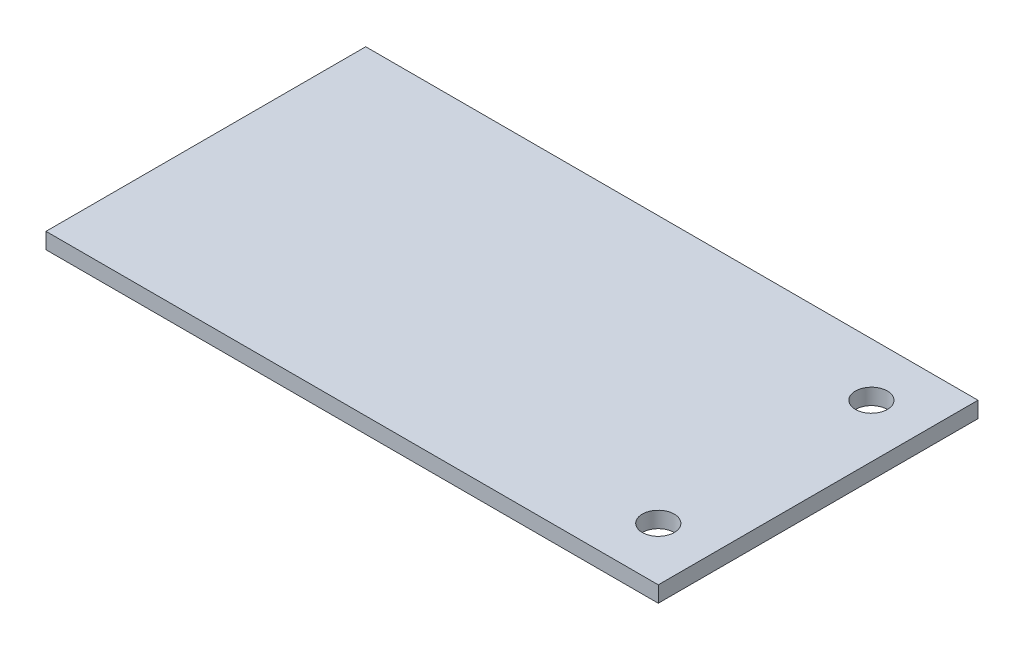
ISO-10303-21;
HEADER;
FILE_DESCRIPTION(('STEP AP214'),'2;1');
FILE_NAME('part.step','',(''),(''),'','','');
FILE_SCHEMA(('AUTOMOTIVE_DESIGN { 1 0 10303 214 1 1 1 1 }'));
ENDSEC;
DATA;
#1=APPLICATION_CONTEXT('core data for automotive mechanical design processes');
#2=APPLICATION_PROTOCOL_DEFINITION('international standard','automotive_design',2000,#1);
#3=PRODUCT_CONTEXT('',#1,'mechanical');
#4=PRODUCT('Part','Part','',(#3));
#5=PRODUCT_RELATED_PRODUCT_CATEGORY('part','',(#4));
#6=PRODUCT_DEFINITION_FORMATION('','',#4);
#7=PRODUCT_DEFINITION_CONTEXT('part definition',#1,'design');
#8=PRODUCT_DEFINITION('design','',#6,#7);
#9=PRODUCT_DEFINITION_SHAPE('','',#8);
#10=(LENGTH_UNIT() NAMED_UNIT(*) SI_UNIT(.MILLI.,.METRE.));
#11=(NAMED_UNIT(*) PLANE_ANGLE_UNIT() SI_UNIT($,.RADIAN.));
#12=(NAMED_UNIT(*) SI_UNIT($,.STERADIAN.) SOLID_ANGLE_UNIT());
#13=UNCERTAINTY_MEASURE_WITH_UNIT(LENGTH_MEASURE(1.E-05),#10,'distance_accuracy_value','');
#14=(GEOMETRIC_REPRESENTATION_CONTEXT(3) GLOBAL_UNCERTAINTY_ASSIGNED_CONTEXT((#13)) GLOBAL_UNIT_ASSIGNED_CONTEXT((#10,
#11,#12)) REPRESENTATION_CONTEXT('',''));
#15=CARTESIAN_POINT('',(0.,0.,0.));
#16=DIRECTION('',(0.,0.,1.));
#17=DIRECTION('',(1.,0.,0.));
#18=AXIS2_PLACEMENT_3D('',#15,#16,#17);
#19=CARTESIAN_POINT('',(-67.5,3.,-55.));
#20=DIRECTION('',(0.,0.,-1.));
#21=DIRECTION('',(0.,-1.,0.));
#22=AXIS2_PLACEMENT_3D('',#19,#20,#21);
#23=PLANE('',#22);
#24=DIRECTION('',(0.,1.,0.));
#25=VECTOR('',#24,1.);
#26=CARTESIAN_POINT('',(-47.4,-0.00100000000000013,-55.));
#27=LINE('',#26,#25);
#28=CARTESIAN_POINT('',(-47.4,0.,-55.));
#29=VERTEX_POINT('',#28);
#30=CARTESIAN_POINT('',(-47.4,3.,-55.));
#31=VERTEX_POINT('',#30);
#32=EDGE_CURVE('E96',#29,#31,#27,.T.);
#33=ORIENTED_EDGE('',*,*,#32,.T.);
#34=DIRECTION('',(1.,0.,0.));
#35=VECTOR('',#34,1.);
#36=CARTESIAN_POINT('',(-67.5,3.,-55.));
#37=LINE('',#36,#35);
#38=CARTESIAN_POINT('',(67.5,3.,-55.));
#39=VERTEX_POINT('',#38);
#40=EDGE_CURVE('E53',#31,#39,#37,.T.);
#41=ORIENTED_EDGE('',*,*,#40,.T.);
#42=DIRECTION('',(0.,-1.,0.));
#43=VECTOR('',#42,1.);
#44=CARTESIAN_POINT('',(67.5,3.,-55.));
#45=LINE('',#44,#43);
#46=CARTESIAN_POINT('',(67.5,0.,-55.));
#47=VERTEX_POINT('',#46);
#48=EDGE_CURVE('E95',#39,#47,#45,.T.);
#49=ORIENTED_EDGE('',*,*,#48,.T.);
#50=DIRECTION('',(1.,0.,0.));
#51=VECTOR('',#50,1.);
#52=CARTESIAN_POINT('',(-67.5,0.,-55.));
#53=LINE('',#52,#51);
#54=EDGE_CURVE('E113',#29,#47,#53,.T.);
#55=ORIENTED_EDGE('',*,*,#54,.F.);
#56=EDGE_LOOP('',(#33,#41,#49,#55));
#57=FACE_BOUND('',#56,.T.);
#58=ADVANCED_FACE('F43',(#57),#23,.T.);
#59=CARTESIAN_POINT('',(67.5,3.,-55.));
#60=DIRECTION('',(1.,0.,0.));
#61=DIRECTION('',(0.,1.,0.));
#62=AXIS2_PLACEMENT_3D('',#59,#60,#61);
#63=PLANE('',#62);
#64=DIRECTION('',(0.,0.,1.));
#65=VECTOR('',#64,1.);
#66=CARTESIAN_POINT('',(67.5,0.,-55.));
#67=LINE('',#66,#65);
#68=CARTESIAN_POINT('',(67.5,0.,5.));
#69=VERTEX_POINT('',#68);
#70=EDGE_CURVE('E82',#47,#69,#67,.T.);
#71=ORIENTED_EDGE('',*,*,#70,.F.);
#72=ORIENTED_EDGE('',*,*,#48,.F.);
#73=DIRECTION('',(0.,0.,1.));
#74=VECTOR('',#73,1.);
#75=CARTESIAN_POINT('',(67.5,3.,-55.));
#76=LINE('',#75,#74);
#77=CARTESIAN_POINT('',(67.5,3.,5.));
#78=VERTEX_POINT('',#77);
#79=EDGE_CURVE('E102',#39,#78,#76,.T.);
#80=ORIENTED_EDGE('',*,*,#79,.T.);
#81=DIRECTION('',(0.,-1.,0.));
#82=VECTOR('',#81,1.);
#83=CARTESIAN_POINT('',(67.5,3.,5.));
#84=LINE('',#83,#82);
#85=EDGE_CURVE('E47',#78,#69,#84,.T.);
#86=ORIENTED_EDGE('',*,*,#85,.T.);
#87=EDGE_LOOP('',(#71,#72,#80,#86));
#88=FACE_BOUND('',#87,.T.);
#89=ADVANCED_FACE('F101',(#88),#63,.T.);
#90=CARTESIAN_POINT('',(67.5,3.,5.));
#91=DIRECTION('',(0.,0.,1.));
#92=DIRECTION('',(1.,0.,0.));
#93=AXIS2_PLACEMENT_3D('',#90,#91,#92);
#94=PLANE('',#93);
#95=DIRECTION('',(-1.,0.,0.));
#96=VECTOR('',#95,1.);
#97=CARTESIAN_POINT('',(67.5,0.,5.));
#98=LINE('',#97,#96);
#99=CARTESIAN_POINT('',(-47.4,0.,5.));
#100=VERTEX_POINT('',#99);
#101=EDGE_CURVE('E114',#69,#100,#98,.T.);
#102=ORIENTED_EDGE('',*,*,#101,.F.);
#103=ORIENTED_EDGE('',*,*,#85,.F.);
#104=DIRECTION('',(-1.,0.,0.));
#105=VECTOR('',#104,1.);
#106=CARTESIAN_POINT('',(67.5,3.,5.));
#107=LINE('',#106,#105);
#108=CARTESIAN_POINT('',(-47.4,3.,5.));
#109=VERTEX_POINT('',#108);
#110=EDGE_CURVE('E105',#78,#109,#107,.T.);
#111=ORIENTED_EDGE('',*,*,#110,.T.);
#112=DIRECTION('',(0.,-1.,0.));
#113=VECTOR('',#112,1.);
#114=CARTESIAN_POINT('',(-47.4,-0.00100000000000013,5.));
#115=LINE('',#114,#113);
#116=EDGE_CURVE('E12',#109,#100,#115,.T.);
#117=ORIENTED_EDGE('',*,*,#116,.T.);
#118=EDGE_LOOP('',(#102,#103,#111,#117));
#119=FACE_BOUND('',#118,.T.);
#120=ADVANCED_FACE('F45',(#119),#94,.T.);
#121=CARTESIAN_POINT('',(0.,3.,0.));
#122=DIRECTION('',(0.,-1.,0.));
#123=DIRECTION('',(0.,0.,-1.));
#124=AXIS2_PLACEMENT_3D('',#121,#122,#123);
#125=PLANE('',#124);
#126=CARTESIAN_POINT('',(57.5000005434817,3.,-45.0000005434817));
#127=DIRECTION('',(0.,-1.,0.));
#128=DIRECTION('',(0.,0.,1.));
#129=AXIS2_PLACEMENT_3D('',#126,#127,#128);
#130=CIRCLE('',#129,3.);
#131=CARTESIAN_POINT('',(57.5000005434817,3.,-42.0000005434817));
#132=VERTEX_POINT('',#131);
#133=EDGE_CURVE('E122',#132,#132,#130,.T.);
#134=ORIENTED_EDGE('',*,*,#133,.T.);
#135=EDGE_LOOP('',(#134));
#136=FACE_BOUND('',#135,.T.);
#137=CARTESIAN_POINT('',(57.5000005434817,3.,-4.99999945651831));
#138=DIRECTION('',(0.,-1.,0.));
#139=DIRECTION('',(0.,0.,-1.));
#140=AXIS2_PLACEMENT_3D('',#137,#138,#139);
#141=CIRCLE('',#140,3.);
#142=CARTESIAN_POINT('',(57.5000005434817,3.,-7.99999945651831));
#143=VERTEX_POINT('',#142);
#144=EDGE_CURVE('E115',#143,#143,#141,.T.);
#145=ORIENTED_EDGE('',*,*,#144,.T.);
#146=EDGE_LOOP('',(#145));
#147=FACE_BOUND('',#146,.T.);
#148=ORIENTED_EDGE('',*,*,#40,.F.);
#149=DIRECTION('',(0.,0.,-1.));
#150=VECTOR('',#149,1.);
#151=CARTESIAN_POINT('',(-47.4,3.,3.2));
#152=LINE('',#151,#150);
#153=EDGE_CURVE('E62',#109,#31,#152,.T.);
#154=ORIENTED_EDGE('',*,*,#153,.F.);
#155=ORIENTED_EDGE('',*,*,#110,.F.);
#156=ORIENTED_EDGE('',*,*,#79,.F.);
#157=EDGE_LOOP('',(#148,#154,#155,#156));
#158=FACE_BOUND('',#157,.T.);
#159=ADVANCED_FACE('F104',(#136,#147,#158),#125,.F.);
#160=CARTESIAN_POINT('',(0.,0.,0.));
#161=DIRECTION('',(0.,-1.,0.));
#162=DIRECTION('',(0.,0.,-1.));
#163=AXIS2_PLACEMENT_3D('',#160,#161,#162);
#164=PLANE('',#163);
#165=CARTESIAN_POINT('',(57.5000005434817,0.,-45.0000005434817));
#166=DIRECTION('',(0.,-1.,0.));
#167=DIRECTION('',(0.,0.,1.));
#168=AXIS2_PLACEMENT_3D('',#165,#166,#167);
#169=CIRCLE('',#168,3.);
#170=CARTESIAN_POINT('',(57.5000005434817,0.,-42.0000005434817));
#171=VERTEX_POINT('',#170);
#172=EDGE_CURVE('E136',#171,#171,#169,.T.);
#173=ORIENTED_EDGE('',*,*,#172,.F.);
#174=EDGE_LOOP('',(#173));
#175=FACE_BOUND('',#174,.T.);
#176=CARTESIAN_POINT('',(57.5000005434817,0.,-4.99999945651831));
#177=DIRECTION('',(0.,-1.,0.));
#178=DIRECTION('',(0.,0.,-1.));
#179=AXIS2_PLACEMENT_3D('',#176,#177,#178);
#180=CIRCLE('',#179,3.);
#181=CARTESIAN_POINT('',(57.5000005434817,0.,-7.99999945651831));
#182=VERTEX_POINT('',#181);
#183=EDGE_CURVE('E119',#182,#182,#180,.T.);
#184=ORIENTED_EDGE('',*,*,#183,.F.);
#185=EDGE_LOOP('',(#184));
#186=FACE_BOUND('',#185,.T.);
#187=DIRECTION('',(0.,0.,-1.));
#188=VECTOR('',#187,1.);
#189=CARTESIAN_POINT('',(-47.4,0.,3.2));
#190=LINE('',#189,#188);
#191=EDGE_CURVE('E118',#100,#29,#190,.T.);
#192=ORIENTED_EDGE('',*,*,#191,.T.);
#193=ORIENTED_EDGE('',*,*,#54,.T.);
#194=ORIENTED_EDGE('',*,*,#70,.T.);
#195=ORIENTED_EDGE('',*,*,#101,.T.);
#196=EDGE_LOOP('',(#192,#193,#194,#195));
#197=FACE_BOUND('',#196,.T.);
#198=ADVANCED_FACE('F155',(#175,#186,#197),#164,.T.);
#199=CARTESIAN_POINT('',(-47.4,-0.00100000000000013,3.2));
#200=DIRECTION('',(1.,0.,0.));
#201=DIRECTION('',(0.,0.,-1.));
#202=AXIS2_PLACEMENT_3D('',#199,#200,#201);
#203=PLANE('',#202);
#204=ORIENTED_EDGE('',*,*,#191,.F.);
#205=ORIENTED_EDGE('',*,*,#116,.F.);
#206=ORIENTED_EDGE('',*,*,#153,.T.);
#207=ORIENTED_EDGE('',*,*,#32,.F.);
#208=EDGE_LOOP('',(#204,#205,#206,#207));
#209=FACE_BOUND('',#208,.T.);
#210=ADVANCED_FACE('F158',(#209),#203,.F.);
#211=CARTESIAN_POINT('',(57.5000005434817,3.,-4.99999945651831));
#212=DIRECTION('',(0.,-1.,0.));
#213=DIRECTION('',(0.,0.,-1.));
#214=AXIS2_PLACEMENT_3D('',#211,#212,#213);
#215=CYLINDRICAL_SURFACE('',#214,3.);
#216=ORIENTED_EDGE('',*,*,#144,.F.);
#217=EDGE_LOOP('',(#216));
#218=FACE_BOUND('',#217,.T.);
#219=ORIENTED_EDGE('',*,*,#183,.T.);
#220=EDGE_LOOP('',(#219));
#221=FACE_BOUND('',#220,.T.);
#222=ADVANCED_FACE('F151',(#218,#221),#215,.F.);
#223=CARTESIAN_POINT('',(57.5000005434817,3.,-45.0000005434817));
#224=DIRECTION('',(0.,-1.,0.));
#225=DIRECTION('',(0.,0.,-1.));
#226=AXIS2_PLACEMENT_3D('',#223,#224,#225);
#227=CYLINDRICAL_SURFACE('',#226,3.);
#228=ORIENTED_EDGE('',*,*,#133,.F.);
#229=EDGE_LOOP('',(#228));
#230=FACE_BOUND('',#229,.T.);
#231=ORIENTED_EDGE('',*,*,#172,.T.);
#232=EDGE_LOOP('',(#231));
#233=FACE_BOUND('',#232,.T.);
#234=ADVANCED_FACE('F148',(#230,#233),#227,.F.);
#235=CLOSED_SHELL('',(#58,#89,#120,#159,#198,#210,#222,#234));
#236=MANIFOLD_SOLID_BREP('B2',#235);
#237=ADVANCED_BREP_SHAPE_REPRESENTATION('',(#18,#236),#14);
#238=SHAPE_DEFINITION_REPRESENTATION(#9,#237);
ENDSEC;
END-ISO-10303-21;
